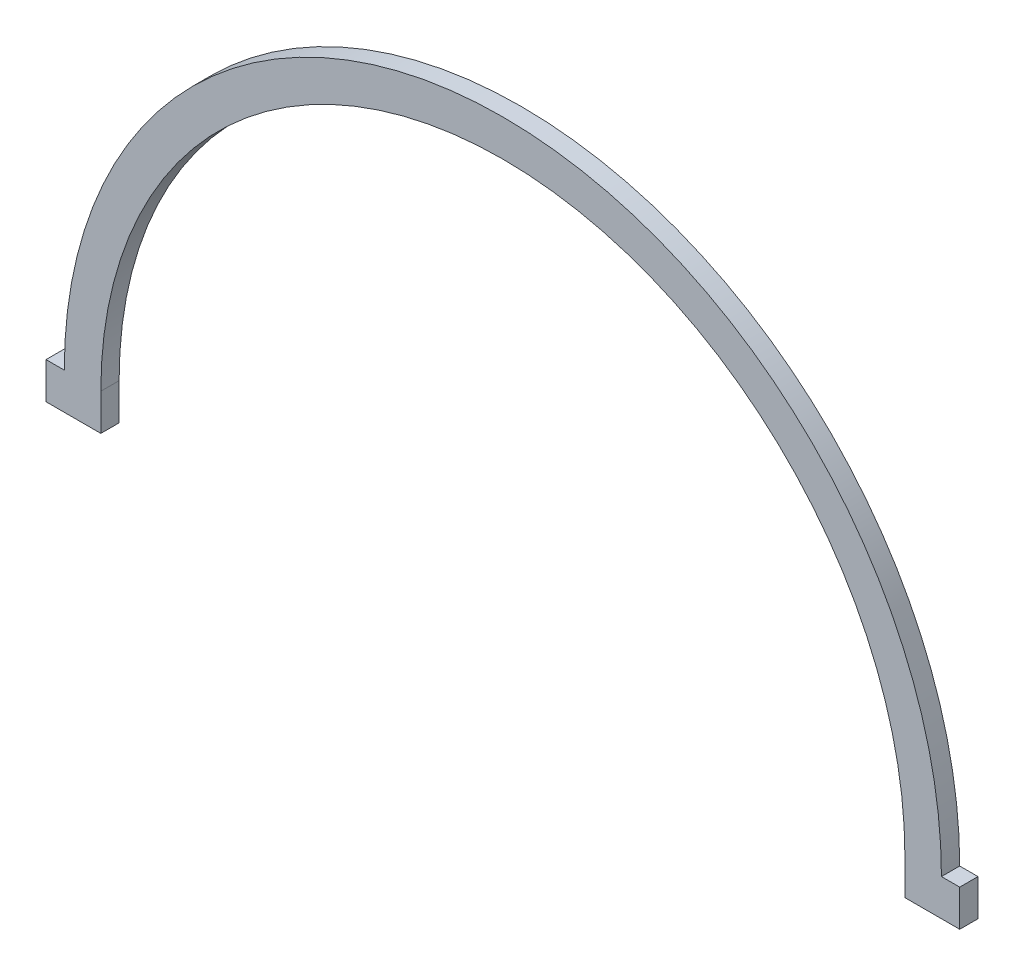
ISO-10303-21;
HEADER;
FILE_DESCRIPTION(('STEP AP214'),'2;1');
FILE_NAME('part.step','',(''),(''),'','','');
FILE_SCHEMA(('AUTOMOTIVE_DESIGN { 1 0 10303 214 1 1 1 1 }'));
ENDSEC;
DATA;
#1=APPLICATION_CONTEXT('core data for automotive mechanical design processes');
#2=APPLICATION_PROTOCOL_DEFINITION('international standard','automotive_design',2000,#1);
#3=PRODUCT_CONTEXT('',#1,'mechanical');
#4=PRODUCT('Part','Part','',(#3));
#5=PRODUCT_RELATED_PRODUCT_CATEGORY('part','',(#4));
#6=PRODUCT_DEFINITION_FORMATION('','',#4);
#7=PRODUCT_DEFINITION_CONTEXT('part definition',#1,'design');
#8=PRODUCT_DEFINITION('design','',#6,#7);
#9=PRODUCT_DEFINITION_SHAPE('','',#8);
#10=(LENGTH_UNIT() NAMED_UNIT(*) SI_UNIT(.MILLI.,.METRE.));
#11=(NAMED_UNIT(*) PLANE_ANGLE_UNIT() SI_UNIT($,.RADIAN.));
#12=(NAMED_UNIT(*) SI_UNIT($,.STERADIAN.) SOLID_ANGLE_UNIT());
#13=UNCERTAINTY_MEASURE_WITH_UNIT(LENGTH_MEASURE(1.E-05),#10,'distance_accuracy_value','');
#14=(GEOMETRIC_REPRESENTATION_CONTEXT(3) GLOBAL_UNCERTAINTY_ASSIGNED_CONTEXT((#13)) GLOBAL_UNIT_ASSIGNED_CONTEXT((#10,
#11,#12)) REPRESENTATION_CONTEXT('',''));
#15=CARTESIAN_POINT('',(0.,0.,0.));
#16=DIRECTION('',(0.,0.,1.));
#17=DIRECTION('',(1.,0.,0.));
#18=AXIS2_PLACEMENT_3D('',#15,#16,#17);
#19=CARTESIAN_POINT('',(-79.375,-6.34999999999999,3.175));
#20=DIRECTION('',(0.,1.,0.));
#21=DIRECTION('',(-1.,0.,0.));
#22=AXIS2_PLACEMENT_3D('',#19,#20,#21);
#23=PLANE('',#22);
#24=DIRECTION('',(1.,0.,0.));
#25=VECTOR('',#24,1.);
#26=CARTESIAN_POINT('',(-79.375,-6.34999999999999,0.));
#27=LINE('',#26,#25);
#28=CARTESIAN_POINT('',(-79.375,-6.34999999999999,0.));
#29=VERTEX_POINT('',#28);
#30=CARTESIAN_POINT('',(-69.85,-6.35000000000001,0.));
#31=VERTEX_POINT('',#30);
#32=EDGE_CURVE('E146',#29,#31,#27,.T.);
#33=ORIENTED_EDGE('',*,*,#32,.T.);
#34=DIRECTION('',(0.,0.,1.));
#35=VECTOR('',#34,1.);
#36=CARTESIAN_POINT('',(-69.85,-6.35000000000001,0.));
#37=LINE('',#36,#35);
#38=CARTESIAN_POINT('',(-69.85,-6.35000000000001,3.175));
#39=VERTEX_POINT('',#38);
#40=EDGE_CURVE('E128',#31,#39,#37,.T.);
#41=ORIENTED_EDGE('',*,*,#40,.T.);
#42=DIRECTION('',(1.,0.,0.));
#43=VECTOR('',#42,1.);
#44=CARTESIAN_POINT('',(-79.375,-6.34999999999999,3.175));
#45=LINE('',#44,#43);
#46=CARTESIAN_POINT('',(-79.375,-6.34999999999999,3.175));
#47=VERTEX_POINT('',#46);
#48=EDGE_CURVE('E205',#47,#39,#45,.T.);
#49=ORIENTED_EDGE('',*,*,#48,.F.);
#50=DIRECTION('',(0.,0.,-1.));
#51=VECTOR('',#50,1.);
#52=CARTESIAN_POINT('',(-79.375,-6.34999999999999,3.175));
#53=LINE('',#52,#51);
#54=EDGE_CURVE('E152',#47,#29,#53,.T.);
#55=ORIENTED_EDGE('',*,*,#54,.T.);
#56=EDGE_LOOP('',(#33,#41,#49,#55));
#57=FACE_BOUND('',#56,.T.);
#58=ADVANCED_FACE('F43',(#57),#23,.F.);
#59=CARTESIAN_POINT('',(0.,0.,3.175));
#60=DIRECTION('',(0.,0.,1.));
#61=DIRECTION('',(1.,0.,0.));
#62=AXIS2_PLACEMENT_3D('',#59,#60,#61);
#63=PLANE('',#62);
#64=DIRECTION('',(0.,-1.,0.));
#65=VECTOR('',#64,1.);
#66=CARTESIAN_POINT('',(-69.85,-4.87759943036386E-13,3.175));
#67=LINE('',#66,#65);
#68=CARTESIAN_POINT('',(-69.85,-4.87759943036386E-13,3.175));
#69=VERTEX_POINT('',#68);
#70=EDGE_CURVE('E134',#69,#39,#67,.T.);
#71=ORIENTED_EDGE('',*,*,#70,.F.);
#72=CARTESIAN_POINT('',(0.,0.,3.175));
#73=DIRECTION('',(0.,0.,1.));
#74=DIRECTION('',(1.,0.,0.));
#75=AXIS2_PLACEMENT_3D('',#72,#73,#74);
#76=CIRCLE('',#75,69.85);
#77=CARTESIAN_POINT('',(69.85,0.,3.175));
#78=VERTEX_POINT('',#77);
#79=EDGE_CURVE('E226',#78,#69,#76,.T.);
#80=ORIENTED_EDGE('',*,*,#79,.F.);
#81=DIRECTION('',(1.,0.,0.));
#82=VECTOR('',#81,1.);
#83=CARTESIAN_POINT('',(-69.85,0.,3.175));
#84=LINE('',#83,#82);
#85=CARTESIAN_POINT('',(69.8324231282597,0.,3.175));
#86=VERTEX_POINT('',#85);
#87=EDGE_CURVE('E223',#86,#78,#84,.T.);
#88=ORIENTED_EDGE('',*,*,#87,.F.);
#89=DIRECTION('',(0.,1.,0.));
#90=VECTOR('',#89,1.);
#91=CARTESIAN_POINT('',(69.8324231282597,-4.87759943036386E-13,3.175));
#92=LINE('',#91,#90);
#93=CARTESIAN_POINT('',(69.8324231282597,-6.35000000000001,3.175));
#94=VERTEX_POINT('',#93);
#95=EDGE_CURVE('E59',#94,#86,#92,.T.);
#96=ORIENTED_EDGE('',*,*,#95,.F.);
#97=CARTESIAN_POINT('',(79.375,-6.35000000000001,3.175));
#98=VERTEX_POINT('',#97);
#99=EDGE_CURVE('E208',#94,#98,#45,.T.);
#100=ORIENTED_EDGE('',*,*,#99,.T.);
#101=DIRECTION('',(0.,1.,0.));
#102=VECTOR('',#101,1.);
#103=CARTESIAN_POINT('',(79.375,0.,3.175));
#104=LINE('',#103,#102);
#105=CARTESIAN_POINT('',(79.375,0.,3.175));
#106=VERTEX_POINT('',#105);
#107=EDGE_CURVE('E202',#98,#106,#104,.T.);
#108=ORIENTED_EDGE('',*,*,#107,.T.);
#109=DIRECTION('',(-1.,0.,0.));
#110=VECTOR('',#109,1.);
#111=CARTESIAN_POINT('',(76.2,0.,3.175));
#112=LINE('',#111,#110);
#113=CARTESIAN_POINT('',(76.2,0.,3.175));
#114=VERTEX_POINT('',#113);
#115=EDGE_CURVE('E173',#106,#114,#112,.T.);
#116=ORIENTED_EDGE('',*,*,#115,.T.);
#117=CARTESIAN_POINT('',(0.,0.,3.175));
#118=DIRECTION('',(0.,0.,1.));
#119=DIRECTION('',(1.,0.,0.));
#120=AXIS2_PLACEMENT_3D('',#117,#118,#119);
#121=CIRCLE('',#120,76.2);
#122=CARTESIAN_POINT('',(-76.2,0.,3.175));
#123=VERTEX_POINT('',#122);
#124=EDGE_CURVE('E167',#114,#123,#121,.T.);
#125=ORIENTED_EDGE('',*,*,#124,.T.);
#126=DIRECTION('',(-1.,0.,0.));
#127=VECTOR('',#126,1.);
#128=CARTESIAN_POINT('',(-79.375,0.,3.175));
#129=LINE('',#128,#127);
#130=CARTESIAN_POINT('',(-79.375,0.,3.175));
#131=VERTEX_POINT('',#130);
#132=EDGE_CURVE('E211',#123,#131,#129,.T.);
#133=ORIENTED_EDGE('',*,*,#132,.T.);
#134=DIRECTION('',(0.,-1.,0.));
#135=VECTOR('',#134,1.);
#136=CARTESIAN_POINT('',(-79.375,0.,3.175));
#137=LINE('',#136,#135);
#138=EDGE_CURVE('E188',#131,#47,#137,.T.);
#139=ORIENTED_EDGE('',*,*,#138,.T.);
#140=ORIENTED_EDGE('',*,*,#48,.T.);
#141=EDGE_LOOP('',(#71,#80,#88,#96,#100,#108,#116,#125,#133,#139,#140));
#142=FACE_BOUND('',#141,.T.);
#143=ADVANCED_FACE('F255',(#142),#63,.T.);
#144=CARTESIAN_POINT('',(0.,0.,0.));
#145=DIRECTION('',(0.,0.,1.));
#146=DIRECTION('',(1.,0.,0.));
#147=AXIS2_PLACEMENT_3D('',#144,#145,#146);
#148=PLANE('',#147);
#149=CARTESIAN_POINT('',(0.,0.,0.));
#150=DIRECTION('',(0.,0.,1.));
#151=DIRECTION('',(1.,0.,0.));
#152=AXIS2_PLACEMENT_3D('',#149,#150,#151);
#153=CIRCLE('',#152,69.85);
#154=CARTESIAN_POINT('',(69.85,0.,0.));
#155=VERTEX_POINT('',#154);
#156=CARTESIAN_POINT('',(-69.85,0.,0.));
#157=VERTEX_POINT('',#156);
#158=EDGE_CURVE('E147',#155,#157,#153,.T.);
#159=ORIENTED_EDGE('',*,*,#158,.T.);
#160=DIRECTION('',(0.,-1.,0.));
#161=VECTOR('',#160,1.);
#162=CARTESIAN_POINT('',(-69.85,-4.87759943036386E-13,0.));
#163=LINE('',#162,#161);
#164=EDGE_CURVE('E131',#157,#31,#163,.T.);
#165=ORIENTED_EDGE('',*,*,#164,.T.);
#166=ORIENTED_EDGE('',*,*,#32,.F.);
#167=DIRECTION('',(0.,-1.,0.));
#168=VECTOR('',#167,1.);
#169=CARTESIAN_POINT('',(-79.375,0.,0.));
#170=LINE('',#169,#168);
#171=CARTESIAN_POINT('',(-79.375,0.,0.));
#172=VERTEX_POINT('',#171);
#173=EDGE_CURVE('E161',#172,#29,#170,.T.);
#174=ORIENTED_EDGE('',*,*,#173,.F.);
#175=DIRECTION('',(-1.,0.,0.));
#176=VECTOR('',#175,1.);
#177=CARTESIAN_POINT('',(-79.375,0.,0.));
#178=LINE('',#177,#176);
#179=CARTESIAN_POINT('',(-76.2,0.,0.));
#180=VERTEX_POINT('',#179);
#181=EDGE_CURVE('E191',#180,#172,#178,.T.);
#182=ORIENTED_EDGE('',*,*,#181,.F.);
#183=CARTESIAN_POINT('',(0.,0.,0.));
#184=DIRECTION('',(0.,0.,1.));
#185=DIRECTION('',(1.,0.,0.));
#186=AXIS2_PLACEMENT_3D('',#183,#184,#185);
#187=CIRCLE('',#186,76.2);
#188=CARTESIAN_POINT('',(76.2,0.,0.));
#189=VERTEX_POINT('',#188);
#190=EDGE_CURVE('E194',#189,#180,#187,.T.);
#191=ORIENTED_EDGE('',*,*,#190,.F.);
#192=DIRECTION('',(-1.,0.,0.));
#193=VECTOR('',#192,1.);
#194=CARTESIAN_POINT('',(76.2,0.,0.));
#195=LINE('',#194,#193);
#196=CARTESIAN_POINT('',(79.375,0.,0.));
#197=VERTEX_POINT('',#196);
#198=EDGE_CURVE('E159',#197,#189,#195,.T.);
#199=ORIENTED_EDGE('',*,*,#198,.F.);
#200=DIRECTION('',(0.,1.,0.));
#201=VECTOR('',#200,1.);
#202=CARTESIAN_POINT('',(79.375,0.,0.));
#203=LINE('',#202,#201);
#204=CARTESIAN_POINT('',(79.375,-6.35000000000001,0.));
#205=VERTEX_POINT('',#204);
#206=EDGE_CURVE('E154',#205,#197,#203,.T.);
#207=ORIENTED_EDGE('',*,*,#206,.F.);
#208=CARTESIAN_POINT('',(69.8324231282597,-6.35000000000001,0.));
#209=VERTEX_POINT('',#208);
#210=EDGE_CURVE('E155',#209,#205,#27,.T.);
#211=ORIENTED_EDGE('',*,*,#210,.F.);
#212=DIRECTION('',(0.,1.,0.));
#213=VECTOR('',#212,1.);
#214=CARTESIAN_POINT('',(69.8324231282597,-4.87759943036386E-13,0.));
#215=LINE('',#214,#213);
#216=CARTESIAN_POINT('',(69.8324231282597,-4.87759943036386E-13,0.));
#217=VERTEX_POINT('',#216);
#218=EDGE_CURVE('E141',#209,#217,#215,.T.);
#219=ORIENTED_EDGE('',*,*,#218,.T.);
#220=DIRECTION('',(1.,0.,0.));
#221=VECTOR('',#220,1.);
#222=CARTESIAN_POINT('',(-69.85,0.,0.));
#223=LINE('',#222,#221);
#224=EDGE_CURVE('E67',#217,#155,#223,.T.);
#225=ORIENTED_EDGE('',*,*,#224,.T.);
#226=EDGE_LOOP('',(#159,#165,#166,#174,#182,#191,#199,#207,#211,#219,#225));
#227=FACE_BOUND('',#226,.T.);
#228=ADVANCED_FACE('F144',(#227),#148,.F.);
#229=CARTESIAN_POINT('',(0.,0.,3.175));
#230=DIRECTION('',(0.,0.,-1.));
#231=DIRECTION('',(-1.,0.,0.));
#232=AXIS2_PLACEMENT_3D('',#229,#230,#231);
#233=CYLINDRICAL_SURFACE('',#232,76.2);
#234=ORIENTED_EDGE('',*,*,#190,.T.);
#235=DIRECTION('',(0.,0.,-1.));
#236=VECTOR('',#235,1.);
#237=CARTESIAN_POINT('',(-76.2,0.,3.175));
#238=LINE('',#237,#236);
#239=EDGE_CURVE('E11',#123,#180,#238,.T.);
#240=ORIENTED_EDGE('',*,*,#239,.F.);
#241=ORIENTED_EDGE('',*,*,#124,.F.);
#242=DIRECTION('',(0.,0.,-1.));
#243=VECTOR('',#242,1.);
#244=CARTESIAN_POINT('',(76.2,0.,3.175));
#245=LINE('',#244,#243);
#246=EDGE_CURVE('E168',#114,#189,#245,.T.);
#247=ORIENTED_EDGE('',*,*,#246,.T.);
#248=EDGE_LOOP('',(#234,#240,#241,#247));
#249=FACE_BOUND('',#248,.T.);
#250=ADVANCED_FACE('F45',(#249),#233,.T.);
#251=CARTESIAN_POINT('',(-79.375,0.,3.175));
#252=DIRECTION('',(0.,-1.,0.));
#253=DIRECTION('',(1.,0.,0.));
#254=AXIS2_PLACEMENT_3D('',#251,#252,#253);
#255=PLANE('',#254);
#256=ORIENTED_EDGE('',*,*,#181,.T.);
#257=DIRECTION('',(0.,0.,-1.));
#258=VECTOR('',#257,1.);
#259=CARTESIAN_POINT('',(-79.375,0.,3.175));
#260=LINE('',#259,#258);
#261=EDGE_CURVE('E52',#131,#172,#260,.T.);
#262=ORIENTED_EDGE('',*,*,#261,.F.);
#263=ORIENTED_EDGE('',*,*,#132,.F.);
#264=ORIENTED_EDGE('',*,*,#239,.T.);
#265=EDGE_LOOP('',(#256,#262,#263,#264));
#266=FACE_BOUND('',#265,.T.);
#267=ADVANCED_FACE('F258',(#266),#255,.F.);
#268=CARTESIAN_POINT('',(-79.375,0.,3.175));
#269=DIRECTION('',(1.,0.,0.));
#270=DIRECTION('',(0.,0.,-1.));
#271=AXIS2_PLACEMENT_3D('',#268,#269,#270);
#272=PLANE('',#271);
#273=ORIENTED_EDGE('',*,*,#173,.T.);
#274=ORIENTED_EDGE('',*,*,#54,.F.);
#275=ORIENTED_EDGE('',*,*,#138,.F.);
#276=ORIENTED_EDGE('',*,*,#261,.T.);
#277=EDGE_LOOP('',(#273,#274,#275,#276));
#278=FACE_BOUND('',#277,.T.);
#279=ADVANCED_FACE('F187',(#278),#272,.F.);
#280=ORIENTED_EDGE('',*,*,#99,.F.);
#281=DIRECTION('',(0.,0.,1.));
#282=VECTOR('',#281,1.);
#283=CARTESIAN_POINT('',(69.8324231282597,-6.35000000000001,0.));
#284=LINE('',#283,#282);
#285=EDGE_CURVE('E140',#209,#94,#284,.T.);
#286=ORIENTED_EDGE('',*,*,#285,.F.);
#287=ORIENTED_EDGE('',*,*,#210,.T.);
#288=DIRECTION('',(0.,0.,-1.));
#289=VECTOR('',#288,1.);
#290=CARTESIAN_POINT('',(79.375,-6.35000000000001,3.175));
#291=LINE('',#290,#289);
#292=EDGE_CURVE('E177',#98,#205,#291,.T.);
#293=ORIENTED_EDGE('',*,*,#292,.F.);
#294=EDGE_LOOP('',(#280,#286,#287,#293));
#295=FACE_BOUND('',#294,.T.);
#296=ADVANCED_FACE('F272',(#295),#23,.F.);
#297=CARTESIAN_POINT('',(79.375,0.,3.175));
#298=DIRECTION('',(-1.,0.,0.));
#299=DIRECTION('',(0.,-1.,0.));
#300=AXIS2_PLACEMENT_3D('',#297,#298,#299);
#301=PLANE('',#300);
#302=ORIENTED_EDGE('',*,*,#206,.T.);
#303=DIRECTION('',(0.,0.,-1.));
#304=VECTOR('',#303,1.);
#305=CARTESIAN_POINT('',(79.375,0.,3.175));
#306=LINE('',#305,#304);
#307=EDGE_CURVE('E172',#106,#197,#306,.T.);
#308=ORIENTED_EDGE('',*,*,#307,.F.);
#309=ORIENTED_EDGE('',*,*,#107,.F.);
#310=ORIENTED_EDGE('',*,*,#292,.T.);
#311=EDGE_LOOP('',(#302,#308,#309,#310));
#312=FACE_BOUND('',#311,.T.);
#313=ADVANCED_FACE('F268',(#312),#301,.F.);
#314=CARTESIAN_POINT('',(76.2,0.,3.175));
#315=DIRECTION('',(0.,-1.,0.));
#316=DIRECTION('',(1.,0.,0.));
#317=AXIS2_PLACEMENT_3D('',#314,#315,#316);
#318=PLANE('',#317);
#319=ORIENTED_EDGE('',*,*,#198,.T.);
#320=ORIENTED_EDGE('',*,*,#246,.F.);
#321=ORIENTED_EDGE('',*,*,#115,.F.);
#322=ORIENTED_EDGE('',*,*,#307,.T.);
#323=EDGE_LOOP('',(#319,#320,#321,#322));
#324=FACE_BOUND('',#323,.T.);
#325=ADVANCED_FACE('F263',(#324),#318,.F.);
#326=CARTESIAN_POINT('',(0.,0.,3.175));
#327=DIRECTION('',(0.,0.,-1.));
#328=DIRECTION('',(-1.,0.,0.));
#329=AXIS2_PLACEMENT_3D('',#326,#327,#328);
#330=CYLINDRICAL_SURFACE('',#329,69.85);
#331=ORIENTED_EDGE('',*,*,#158,.F.);
#332=DIRECTION('',(0.,0.,-1.));
#333=VECTOR('',#332,1.);
#334=CARTESIAN_POINT('',(69.85,0.,3.175));
#335=LINE('',#334,#333);
#336=EDGE_CURVE('E219',#78,#155,#335,.T.);
#337=ORIENTED_EDGE('',*,*,#336,.F.);
#338=ORIENTED_EDGE('',*,*,#79,.T.);
#339=DIRECTION('',(0.,0.,-1.));
#340=VECTOR('',#339,1.);
#341=CARTESIAN_POINT('',(-69.85,0.,3.175));
#342=LINE('',#341,#340);
#343=EDGE_CURVE('E197',#69,#157,#342,.T.);
#344=ORIENTED_EDGE('',*,*,#343,.T.);
#345=EDGE_LOOP('',(#331,#337,#338,#344));
#346=FACE_BOUND('',#345,.T.);
#347=ADVANCED_FACE('F253',(#346),#330,.F.);
#348=CARTESIAN_POINT('',(-69.85,0.,3.175));
#349=DIRECTION('',(0.,1.,0.));
#350=DIRECTION('',(0.,0.,1.));
#351=AXIS2_PLACEMENT_3D('',#348,#349,#350);
#352=PLANE('',#351);
#353=DIRECTION('',(0.,0.,1.));
#354=VECTOR('',#353,1.);
#355=CARTESIAN_POINT('',(69.8324231282597,-4.87759943036386E-13,0.));
#356=LINE('',#355,#354);
#357=EDGE_CURVE('E229',#217,#86,#356,.T.);
#358=ORIENTED_EDGE('',*,*,#357,.T.);
#359=ORIENTED_EDGE('',*,*,#87,.T.);
#360=ORIENTED_EDGE('',*,*,#336,.T.);
#361=ORIENTED_EDGE('',*,*,#224,.F.);
#362=EDGE_LOOP('',(#358,#359,#360,#361));
#363=FACE_BOUND('',#362,.T.);
#364=ADVANCED_FACE('F248',(#363),#352,.T.);
#365=CARTESIAN_POINT('',(69.8324231282597,-4.87759943036386E-13,0.));
#366=DIRECTION('',(1.,0.,0.));
#367=DIRECTION('',(0.,0.,-1.));
#368=AXIS2_PLACEMENT_3D('',#365,#366,#367);
#369=PLANE('',#368);
#370=ORIENTED_EDGE('',*,*,#95,.T.);
#371=ORIENTED_EDGE('',*,*,#357,.F.);
#372=ORIENTED_EDGE('',*,*,#218,.F.);
#373=ORIENTED_EDGE('',*,*,#285,.T.);
#374=EDGE_LOOP('',(#370,#371,#372,#373));
#375=FACE_BOUND('',#374,.T.);
#376=ADVANCED_FACE('F273',(#375),#369,.F.);
#377=CARTESIAN_POINT('',(-69.85,-4.87759943036386E-13,0.));
#378=DIRECTION('',(-1.,0.,0.));
#379=DIRECTION('',(0.,0.,1.));
#380=AXIS2_PLACEMENT_3D('',#377,#378,#379);
#381=PLANE('',#380);
#382=ORIENTED_EDGE('',*,*,#70,.T.);
#383=ORIENTED_EDGE('',*,*,#40,.F.);
#384=ORIENTED_EDGE('',*,*,#164,.F.);
#385=ORIENTED_EDGE('',*,*,#343,.F.);
#386=EDGE_LOOP('',(#382,#383,#384,#385));
#387=FACE_BOUND('',#386,.T.);
#388=ADVANCED_FACE('F130',(#387),#381,.F.);
#389=CLOSED_SHELL('',(#58,#143,#228,#250,#267,#279,#296,#313,#325,#347,#364,#376,#388));
#390=MANIFOLD_SOLID_BREP('B2',#389);
#391=ADVANCED_BREP_SHAPE_REPRESENTATION('',(#18,#390),#14);
#392=SHAPE_DEFINITION_REPRESENTATION(#9,#391);
ENDSEC;
END-ISO-10303-21;
